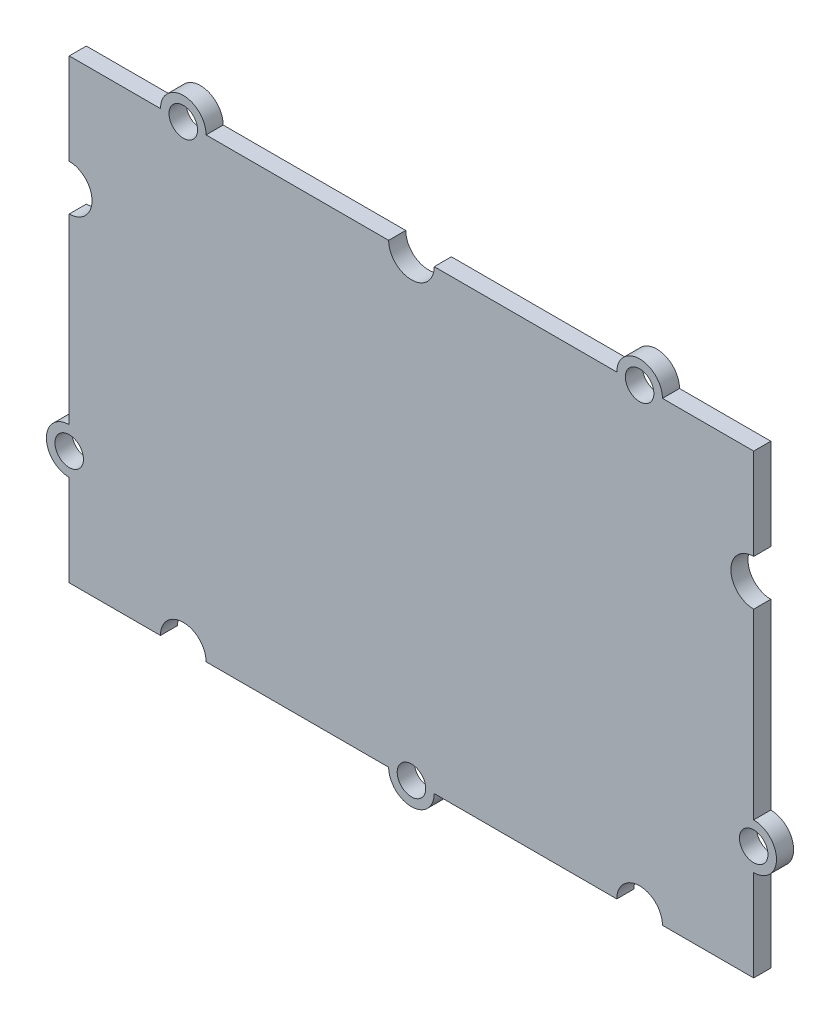
ISO-10303-21;
HEADER;
FILE_DESCRIPTION(('STEP AP214'),'2;1');
FILE_NAME('part.step','',(''),(''),'','','');
FILE_SCHEMA(('AUTOMOTIVE_DESIGN { 1 0 10303 214 1 1 1 1 }'));
ENDSEC;
DATA;
#1=APPLICATION_CONTEXT('core data for automotive mechanical design processes');
#2=APPLICATION_PROTOCOL_DEFINITION('international standard','automotive_design',2000,#1);
#3=PRODUCT_CONTEXT('',#1,'mechanical');
#4=PRODUCT('Part','Part','',(#3));
#5=PRODUCT_RELATED_PRODUCT_CATEGORY('part','',(#4));
#6=PRODUCT_DEFINITION_FORMATION('','',#4);
#7=PRODUCT_DEFINITION_CONTEXT('part definition',#1,'design');
#8=PRODUCT_DEFINITION('design','',#6,#7);
#9=PRODUCT_DEFINITION_SHAPE('','',#8);
#10=(LENGTH_UNIT() NAMED_UNIT(*) SI_UNIT(.MILLI.,.METRE.));
#11=(NAMED_UNIT(*) PLANE_ANGLE_UNIT() SI_UNIT($,.RADIAN.));
#12=(NAMED_UNIT(*) SI_UNIT($,.STERADIAN.) SOLID_ANGLE_UNIT());
#13=UNCERTAINTY_MEASURE_WITH_UNIT(LENGTH_MEASURE(1.E-05),#10,'distance_accuracy_value','');
#14=(GEOMETRIC_REPRESENTATION_CONTEXT(3) GLOBAL_UNCERTAINTY_ASSIGNED_CONTEXT((#13)) GLOBAL_UNIT_ASSIGNED_CONTEXT((#10,
#11,#12)) REPRESENTATION_CONTEXT('',''));
#15=CARTESIAN_POINT('',(0.,0.,0.));
#16=DIRECTION('',(0.,0.,1.));
#17=DIRECTION('',(1.,0.,0.));
#18=AXIS2_PLACEMENT_3D('',#15,#16,#17);
#19=CARTESIAN_POINT('',(-30.,10.,1.5));
#20=DIRECTION('',(0.,0.,1.));
#21=DIRECTION('',(1.,0.,0.));
#22=AXIS2_PLACEMENT_3D('',#19,#20,#21);
#23=PLANE('',#22);
#24=CARTESIAN_POINT('',(0.,-20.,1.5));
#25=DIRECTION('',(0.,0.,1.));
#26=DIRECTION('',(1.,0.,0.));
#27=AXIS2_PLACEMENT_3D('',#24,#25,#26);
#28=CIRCLE('',#27,1.25);
#29=CARTESIAN_POINT('',(1.25,-20.,1.5));
#30=VERTEX_POINT('',#29);
#31=EDGE_CURVE('E452',#30,#30,#28,.T.);
#32=ORIENTED_EDGE('',*,*,#31,.F.);
#33=EDGE_LOOP('',(#32));
#34=FACE_BOUND('',#33,.T.);
#35=CARTESIAN_POINT('',(20.,20.,1.5));
#36=DIRECTION('',(0.,0.,1.));
#37=DIRECTION('',(1.,0.,0.));
#38=AXIS2_PLACEMENT_3D('',#35,#36,#37);
#39=CIRCLE('',#38,1.25);
#40=CARTESIAN_POINT('',(21.25,20.,1.5));
#41=VERTEX_POINT('',#40);
#42=EDGE_CURVE('E464',#41,#41,#39,.T.);
#43=ORIENTED_EDGE('',*,*,#42,.F.);
#44=EDGE_LOOP('',(#43));
#45=FACE_BOUND('',#44,.T.);
#46=DIRECTION('',(0.,-1.,0.));
#47=VECTOR('',#46,1.);
#48=CARTESIAN_POINT('',(-30.,20.,1.5));
#49=LINE('',#48,#47);
#50=CARTESIAN_POINT('',(-30.,20.,1.5));
#51=VERTEX_POINT('',#50);
#52=CARTESIAN_POINT('',(-30.,12.,1.5));
#53=VERTEX_POINT('',#52);
#54=EDGE_CURVE('E274',#51,#53,#49,.T.);
#55=ORIENTED_EDGE('',*,*,#54,.T.);
#56=CARTESIAN_POINT('',(-30.,10.,1.5));
#57=DIRECTION('',(0.,0.,-1.));
#58=DIRECTION('',(1.,0.,0.));
#59=AXIS2_PLACEMENT_3D('',#56,#57,#58);
#60=CIRCLE('',#59,2.);
#61=CARTESIAN_POINT('',(-30.,8.,1.5));
#62=VERTEX_POINT('',#61);
#63=EDGE_CURVE('E142',#53,#62,#60,.T.);
#64=ORIENTED_EDGE('',*,*,#63,.T.);
#65=DIRECTION('',(0.,-1.,0.));
#66=VECTOR('',#65,1.);
#67=CARTESIAN_POINT('',(-30.,8.,1.5));
#68=LINE('',#67,#66);
#69=CARTESIAN_POINT('',(-30.,-8.,1.5));
#70=VERTEX_POINT('',#69);
#71=EDGE_CURVE('E337',#62,#70,#68,.T.);
#72=ORIENTED_EDGE('',*,*,#71,.T.);
#73=CARTESIAN_POINT('',(-30.,-10.,1.5));
#74=DIRECTION('',(0.,0.,1.));
#75=DIRECTION('',(1.,0.,0.));
#76=AXIS2_PLACEMENT_3D('',#73,#74,#75);
#77=CIRCLE('',#76,2.);
#78=CARTESIAN_POINT('',(-30.,-12.,1.5));
#79=VERTEX_POINT('',#78);
#80=EDGE_CURVE('E356',#70,#79,#77,.T.);
#81=ORIENTED_EDGE('',*,*,#80,.T.);
#82=DIRECTION('',(0.,-1.,0.));
#83=VECTOR('',#82,1.);
#84=CARTESIAN_POINT('',(-30.,-12.,1.5));
#85=LINE('',#84,#83);
#86=CARTESIAN_POINT('',(-30.,-20.,1.5));
#87=VERTEX_POINT('',#86);
#88=EDGE_CURVE('E353',#79,#87,#85,.T.);
#89=ORIENTED_EDGE('',*,*,#88,.T.);
#90=DIRECTION('',(1.,0.,0.));
#91=VECTOR('',#90,1.);
#92=CARTESIAN_POINT('',(-30.,-20.,1.5));
#93=LINE('',#92,#91);
#94=CARTESIAN_POINT('',(-22.,-20.,1.5));
#95=VERTEX_POINT('',#94);
#96=EDGE_CURVE('E355',#87,#95,#93,.T.);
#97=ORIENTED_EDGE('',*,*,#96,.T.);
#98=CARTESIAN_POINT('',(-20.,-20.,1.5));
#99=DIRECTION('',(0.,0.,-1.));
#100=DIRECTION('',(1.,0.,0.));
#101=AXIS2_PLACEMENT_3D('',#98,#99,#100);
#102=CIRCLE('',#101,2.);
#103=CARTESIAN_POINT('',(-18.,-20.,1.5));
#104=VERTEX_POINT('',#103);
#105=EDGE_CURVE('E358',#95,#104,#102,.T.);
#106=ORIENTED_EDGE('',*,*,#105,.T.);
#107=DIRECTION('',(1.,0.,0.));
#108=VECTOR('',#107,1.);
#109=CARTESIAN_POINT('',(-18.,-20.,1.5));
#110=LINE('',#109,#108);
#111=CARTESIAN_POINT('',(-2.,-20.,1.5));
#112=VERTEX_POINT('',#111);
#113=EDGE_CURVE('E364',#104,#112,#110,.T.);
#114=ORIENTED_EDGE('',*,*,#113,.T.);
#115=CARTESIAN_POINT('',(0.,-20.,1.5));
#116=DIRECTION('',(0.,0.,1.));
#117=DIRECTION('',(1.,0.,0.));
#118=AXIS2_PLACEMENT_3D('',#115,#116,#117);
#119=CIRCLE('',#118,2.);
#120=CARTESIAN_POINT('',(2.,-20.,1.5));
#121=VERTEX_POINT('',#120);
#122=EDGE_CURVE('E366',#112,#121,#119,.T.);
#123=ORIENTED_EDGE('',*,*,#122,.T.);
#124=DIRECTION('',(1.,0.,0.));
#125=VECTOR('',#124,1.);
#126=CARTESIAN_POINT('',(2.,-20.,1.5));
#127=LINE('',#126,#125);
#128=CARTESIAN_POINT('',(18.,-20.,1.5));
#129=VERTEX_POINT('',#128);
#130=EDGE_CURVE('E368',#121,#129,#127,.T.);
#131=ORIENTED_EDGE('',*,*,#130,.T.);
#132=CARTESIAN_POINT('',(20.,-20.,1.5));
#133=DIRECTION('',(0.,0.,-1.));
#134=DIRECTION('',(1.,0.,0.));
#135=AXIS2_PLACEMENT_3D('',#132,#133,#134);
#136=CIRCLE('',#135,2.);
#137=CARTESIAN_POINT('',(22.,-20.,1.5));
#138=VERTEX_POINT('',#137);
#139=EDGE_CURVE('E370',#129,#138,#136,.T.);
#140=ORIENTED_EDGE('',*,*,#139,.T.);
#141=DIRECTION('',(1.,0.,0.));
#142=VECTOR('',#141,1.);
#143=CARTESIAN_POINT('',(22.,-20.,1.5));
#144=LINE('',#143,#142);
#145=CARTESIAN_POINT('',(30.,-20.,1.5));
#146=VERTEX_POINT('',#145);
#147=EDGE_CURVE('E372',#138,#146,#144,.T.);
#148=ORIENTED_EDGE('',*,*,#147,.T.);
#149=DIRECTION('',(0.,1.,0.));
#150=VECTOR('',#149,1.);
#151=CARTESIAN_POINT('',(30.,-12.,1.5));
#152=LINE('',#151,#150);
#153=CARTESIAN_POINT('',(30.,-12.,1.5));
#154=VERTEX_POINT('',#153);
#155=EDGE_CURVE('E374',#146,#154,#152,.T.);
#156=ORIENTED_EDGE('',*,*,#155,.T.);
#157=CARTESIAN_POINT('',(30.,-10.,1.5));
#158=DIRECTION('',(0.,0.,1.));
#159=DIRECTION('',(1.,0.,0.));
#160=AXIS2_PLACEMENT_3D('',#157,#158,#159);
#161=CIRCLE('',#160,2.);
#162=CARTESIAN_POINT('',(30.,-8.,1.5));
#163=VERTEX_POINT('',#162);
#164=EDGE_CURVE('E376',#154,#163,#161,.T.);
#165=ORIENTED_EDGE('',*,*,#164,.T.);
#166=DIRECTION('',(0.,1.,0.));
#167=VECTOR('',#166,1.);
#168=CARTESIAN_POINT('',(30.,8.,1.5));
#169=LINE('',#168,#167);
#170=CARTESIAN_POINT('',(30.,8.,1.5));
#171=VERTEX_POINT('',#170);
#172=EDGE_CURVE('E378',#163,#171,#169,.T.);
#173=ORIENTED_EDGE('',*,*,#172,.T.);
#174=CARTESIAN_POINT('',(30.,10.,1.5));
#175=DIRECTION('',(0.,0.,-1.));
#176=DIRECTION('',(1.,0.,0.));
#177=AXIS2_PLACEMENT_3D('',#174,#175,#176);
#178=CIRCLE('',#177,2.);
#179=CARTESIAN_POINT('',(30.,12.,1.5));
#180=VERTEX_POINT('',#179);
#181=EDGE_CURVE('E380',#171,#180,#178,.T.);
#182=ORIENTED_EDGE('',*,*,#181,.T.);
#183=DIRECTION('',(0.,1.,0.));
#184=VECTOR('',#183,1.);
#185=CARTESIAN_POINT('',(30.,20.,1.5));
#186=LINE('',#185,#184);
#187=CARTESIAN_POINT('',(30.,20.,1.5));
#188=VERTEX_POINT('',#187);
#189=EDGE_CURVE('E382',#180,#188,#186,.T.);
#190=ORIENTED_EDGE('',*,*,#189,.T.);
#191=DIRECTION('',(-1.,0.,0.));
#192=VECTOR('',#191,1.);
#193=CARTESIAN_POINT('',(22.,20.,1.5));
#194=LINE('',#193,#192);
#195=CARTESIAN_POINT('',(22.,20.,1.5));
#196=VERTEX_POINT('',#195);
#197=EDGE_CURVE('E384',#188,#196,#194,.T.);
#198=ORIENTED_EDGE('',*,*,#197,.T.);
#199=CARTESIAN_POINT('',(20.,20.,1.5));
#200=DIRECTION('',(0.,0.,1.));
#201=DIRECTION('',(1.,0.,0.));
#202=AXIS2_PLACEMENT_3D('',#199,#200,#201);
#203=CIRCLE('',#202,2.);
#204=CARTESIAN_POINT('',(18.,20.,1.5));
#205=VERTEX_POINT('',#204);
#206=EDGE_CURVE('E386',#196,#205,#203,.T.);
#207=ORIENTED_EDGE('',*,*,#206,.T.);
#208=DIRECTION('',(-1.,0.,0.));
#209=VECTOR('',#208,1.);
#210=CARTESIAN_POINT('',(2.,20.,1.5));
#211=LINE('',#210,#209);
#212=CARTESIAN_POINT('',(2.,20.,1.5));
#213=VERTEX_POINT('',#212);
#214=EDGE_CURVE('E388',#205,#213,#211,.T.);
#215=ORIENTED_EDGE('',*,*,#214,.T.);
#216=CARTESIAN_POINT('',(0.,20.,1.5));
#217=DIRECTION('',(0.,0.,-1.));
#218=DIRECTION('',(1.,0.,0.));
#219=AXIS2_PLACEMENT_3D('',#216,#217,#218);
#220=CIRCLE('',#219,2.);
#221=CARTESIAN_POINT('',(-2.,20.,1.5));
#222=VERTEX_POINT('',#221);
#223=EDGE_CURVE('E209',#213,#222,#220,.T.);
#224=ORIENTED_EDGE('',*,*,#223,.T.);
#225=DIRECTION('',(-1.,0.,0.));
#226=VECTOR('',#225,1.);
#227=CARTESIAN_POINT('',(-18.,20.,1.5));
#228=LINE('',#227,#226);
#229=CARTESIAN_POINT('',(-18.,20.,1.5));
#230=VERTEX_POINT('',#229);
#231=EDGE_CURVE('E203',#222,#230,#228,.T.);
#232=ORIENTED_EDGE('',*,*,#231,.T.);
#233=CARTESIAN_POINT('',(-20.,20.,1.5));
#234=DIRECTION('',(0.,0.,1.));
#235=DIRECTION('',(1.,0.,0.));
#236=AXIS2_PLACEMENT_3D('',#233,#234,#235);
#237=CIRCLE('',#236,2.);
#238=CARTESIAN_POINT('',(-22.,20.,1.5));
#239=VERTEX_POINT('',#238);
#240=EDGE_CURVE('E207',#230,#239,#237,.T.);
#241=ORIENTED_EDGE('',*,*,#240,.T.);
#242=DIRECTION('',(-1.,0.,0.));
#243=VECTOR('',#242,1.);
#244=CARTESIAN_POINT('',(-30.,20.,1.5));
#245=LINE('',#244,#243);
#246=EDGE_CURVE('E51',#239,#51,#245,.T.);
#247=ORIENTED_EDGE('',*,*,#246,.T.);
#248=EDGE_LOOP('',(#55,#64,#72,#81,#89,#97,#106,#114,#123,#131,#140,#148,#156,#165,#173,#182,
#190,#198,#207,#215,#224,#232,#241,#247));
#249=FACE_BOUND('',#248,.T.);
#250=CARTESIAN_POINT('',(-20.,20.,1.5));
#251=DIRECTION('',(0.,0.,1.));
#252=DIRECTION('',(1.,0.,0.));
#253=AXIS2_PLACEMENT_3D('',#250,#251,#252);
#254=CIRCLE('',#253,1.25);
#255=CARTESIAN_POINT('',(-18.75,20.,1.5));
#256=VERTEX_POINT('',#255);
#257=EDGE_CURVE('E231',#256,#256,#254,.T.);
#258=ORIENTED_EDGE('',*,*,#257,.F.);
#259=EDGE_LOOP('',(#258));
#260=FACE_BOUND('',#259,.T.);
#261=CARTESIAN_POINT('',(30.,-10.,1.5));
#262=DIRECTION('',(0.,0.,1.));
#263=DIRECTION('',(1.,0.,0.));
#264=AXIS2_PLACEMENT_3D('',#261,#262,#263);
#265=CIRCLE('',#264,1.25);
#266=CARTESIAN_POINT('',(31.25,-10.,1.5));
#267=VERTEX_POINT('',#266);
#268=EDGE_CURVE('E458',#267,#267,#265,.T.);
#269=ORIENTED_EDGE('',*,*,#268,.F.);
#270=EDGE_LOOP('',(#269));
#271=FACE_BOUND('',#270,.T.);
#272=CARTESIAN_POINT('',(-30.,-10.,1.5));
#273=DIRECTION('',(0.,0.,1.));
#274=DIRECTION('',(1.,0.,0.));
#275=AXIS2_PLACEMENT_3D('',#272,#273,#274);
#276=CIRCLE('',#275,1.25);
#277=CARTESIAN_POINT('',(-28.75,-10.,1.5));
#278=VERTEX_POINT('',#277);
#279=EDGE_CURVE('E443',#278,#278,#276,.T.);
#280=ORIENTED_EDGE('',*,*,#279,.F.);
#281=EDGE_LOOP('',(#280));
#282=FACE_BOUND('',#281,.T.);
#283=ADVANCED_FACE('F34',(#34,#45,#249,#260,#271,#282),#23,.T.);
#284=CARTESIAN_POINT('',(-30.,10.,0.));
#285=DIRECTION('',(0.,0.,1.));
#286=DIRECTION('',(1.,0.,0.));
#287=AXIS2_PLACEMENT_3D('',#284,#285,#286);
#288=PLANE('',#287);
#289=DIRECTION('',(0.,-1.,0.));
#290=VECTOR('',#289,1.);
#291=CARTESIAN_POINT('',(-30.,20.,0.));
#292=LINE('',#291,#290);
#293=CARTESIAN_POINT('',(-30.,20.,0.));
#294=VERTEX_POINT('',#293);
#295=CARTESIAN_POINT('',(-30.,12.,0.));
#296=VERTEX_POINT('',#295);
#297=EDGE_CURVE('E227',#294,#296,#292,.T.);
#298=ORIENTED_EDGE('',*,*,#297,.F.);
#299=DIRECTION('',(-1.,0.,0.));
#300=VECTOR('',#299,1.);
#301=CARTESIAN_POINT('',(-30.,20.,0.));
#302=LINE('',#301,#300);
#303=CARTESIAN_POINT('',(-22.,20.,0.));
#304=VERTEX_POINT('',#303);
#305=EDGE_CURVE('E134',#304,#294,#302,.T.);
#306=ORIENTED_EDGE('',*,*,#305,.F.);
#307=CARTESIAN_POINT('',(-20.,20.,0.));
#308=DIRECTION('',(0.,0.,1.));
#309=DIRECTION('',(1.,0.,0.));
#310=AXIS2_PLACEMENT_3D('',#307,#308,#309);
#311=CIRCLE('',#310,2.);
#312=CARTESIAN_POINT('',(-18.,20.,0.));
#313=VERTEX_POINT('',#312);
#314=EDGE_CURVE('E128',#313,#304,#311,.T.);
#315=ORIENTED_EDGE('',*,*,#314,.F.);
#316=DIRECTION('',(-1.,0.,0.));
#317=VECTOR('',#316,1.);
#318=CARTESIAN_POINT('',(-18.,20.,0.));
#319=LINE('',#318,#317);
#320=CARTESIAN_POINT('',(-2.,20.,0.));
#321=VERTEX_POINT('',#320);
#322=EDGE_CURVE('E217',#321,#313,#319,.T.);
#323=ORIENTED_EDGE('',*,*,#322,.F.);
#324=CARTESIAN_POINT('',(0.,20.,0.));
#325=DIRECTION('',(0.,0.,-1.));
#326=DIRECTION('',(1.,0.,0.));
#327=AXIS2_PLACEMENT_3D('',#324,#325,#326);
#328=CIRCLE('',#327,2.);
#329=CARTESIAN_POINT('',(2.,20.,0.));
#330=VERTEX_POINT('',#329);
#331=EDGE_CURVE('E269',#330,#321,#328,.T.);
#332=ORIENTED_EDGE('',*,*,#331,.F.);
#333=DIRECTION('',(-1.,0.,0.));
#334=VECTOR('',#333,1.);
#335=CARTESIAN_POINT('',(2.,20.,0.));
#336=LINE('',#335,#334);
#337=CARTESIAN_POINT('',(18.,20.,0.));
#338=VERTEX_POINT('',#337);
#339=EDGE_CURVE('E267',#338,#330,#336,.T.);
#340=ORIENTED_EDGE('',*,*,#339,.F.);
#341=CARTESIAN_POINT('',(20.,20.,0.));
#342=DIRECTION('',(0.,0.,1.));
#343=DIRECTION('',(1.,0.,0.));
#344=AXIS2_PLACEMENT_3D('',#341,#342,#343);
#345=CIRCLE('',#344,2.);
#346=CARTESIAN_POINT('',(22.,20.,0.));
#347=VERTEX_POINT('',#346);
#348=EDGE_CURVE('E265',#347,#338,#345,.T.);
#349=ORIENTED_EDGE('',*,*,#348,.F.);
#350=DIRECTION('',(-1.,0.,0.));
#351=VECTOR('',#350,1.);
#352=CARTESIAN_POINT('',(22.,20.,0.));
#353=LINE('',#352,#351);
#354=CARTESIAN_POINT('',(30.,20.,0.));
#355=VERTEX_POINT('',#354);
#356=EDGE_CURVE('E263',#355,#347,#353,.T.);
#357=ORIENTED_EDGE('',*,*,#356,.F.);
#358=DIRECTION('',(0.,1.,0.));
#359=VECTOR('',#358,1.);
#360=CARTESIAN_POINT('',(30.,20.,0.));
#361=LINE('',#360,#359);
#362=CARTESIAN_POINT('',(30.,12.,0.));
#363=VERTEX_POINT('',#362);
#364=EDGE_CURVE('E261',#363,#355,#361,.T.);
#365=ORIENTED_EDGE('',*,*,#364,.F.);
#366=CARTESIAN_POINT('',(30.,10.,0.));
#367=DIRECTION('',(0.,0.,-1.));
#368=DIRECTION('',(1.,0.,0.));
#369=AXIS2_PLACEMENT_3D('',#366,#367,#368);
#370=CIRCLE('',#369,2.);
#371=CARTESIAN_POINT('',(30.,8.,0.));
#372=VERTEX_POINT('',#371);
#373=EDGE_CURVE('E259',#372,#363,#370,.T.);
#374=ORIENTED_EDGE('',*,*,#373,.F.);
#375=DIRECTION('',(0.,1.,0.));
#376=VECTOR('',#375,1.);
#377=CARTESIAN_POINT('',(30.,8.,0.));
#378=LINE('',#377,#376);
#379=CARTESIAN_POINT('',(30.,-8.,0.));
#380=VERTEX_POINT('',#379);
#381=EDGE_CURVE('E257',#380,#372,#378,.T.);
#382=ORIENTED_EDGE('',*,*,#381,.F.);
#383=CARTESIAN_POINT('',(30.,-10.,0.));
#384=DIRECTION('',(0.,0.,1.));
#385=DIRECTION('',(1.,0.,0.));
#386=AXIS2_PLACEMENT_3D('',#383,#384,#385);
#387=CIRCLE('',#386,2.);
#388=CARTESIAN_POINT('',(30.,-12.,0.));
#389=VERTEX_POINT('',#388);
#390=EDGE_CURVE('E255',#389,#380,#387,.T.);
#391=ORIENTED_EDGE('',*,*,#390,.F.);
#392=DIRECTION('',(0.,1.,0.));
#393=VECTOR('',#392,1.);
#394=CARTESIAN_POINT('',(30.,-12.,0.));
#395=LINE('',#394,#393);
#396=CARTESIAN_POINT('',(30.,-20.,0.));
#397=VERTEX_POINT('',#396);
#398=EDGE_CURVE('E253',#397,#389,#395,.T.);
#399=ORIENTED_EDGE('',*,*,#398,.F.);
#400=DIRECTION('',(1.,0.,0.));
#401=VECTOR('',#400,1.);
#402=CARTESIAN_POINT('',(22.,-20.,0.));
#403=LINE('',#402,#401);
#404=CARTESIAN_POINT('',(22.,-20.,0.));
#405=VERTEX_POINT('',#404);
#406=EDGE_CURVE('E251',#405,#397,#403,.T.);
#407=ORIENTED_EDGE('',*,*,#406,.F.);
#408=CARTESIAN_POINT('',(20.,-20.,0.));
#409=DIRECTION('',(0.,0.,-1.));
#410=DIRECTION('',(1.,0.,0.));
#411=AXIS2_PLACEMENT_3D('',#408,#409,#410);
#412=CIRCLE('',#411,2.);
#413=CARTESIAN_POINT('',(18.,-20.,0.));
#414=VERTEX_POINT('',#413);
#415=EDGE_CURVE('E249',#414,#405,#412,.T.);
#416=ORIENTED_EDGE('',*,*,#415,.F.);
#417=DIRECTION('',(1.,0.,0.));
#418=VECTOR('',#417,1.);
#419=CARTESIAN_POINT('',(2.,-20.,0.));
#420=LINE('',#419,#418);
#421=CARTESIAN_POINT('',(2.,-20.,0.));
#422=VERTEX_POINT('',#421);
#423=EDGE_CURVE('E247',#422,#414,#420,.T.);
#424=ORIENTED_EDGE('',*,*,#423,.F.);
#425=CARTESIAN_POINT('',(0.,-20.,0.));
#426=DIRECTION('',(0.,0.,1.));
#427=DIRECTION('',(1.,0.,0.));
#428=AXIS2_PLACEMENT_3D('',#425,#426,#427);
#429=CIRCLE('',#428,2.);
#430=CARTESIAN_POINT('',(-2.,-20.,0.));
#431=VERTEX_POINT('',#430);
#432=EDGE_CURVE('E245',#431,#422,#429,.T.);
#433=ORIENTED_EDGE('',*,*,#432,.F.);
#434=DIRECTION('',(1.,0.,0.));
#435=VECTOR('',#434,1.);
#436=CARTESIAN_POINT('',(-18.,-20.,0.));
#437=LINE('',#436,#435);
#438=CARTESIAN_POINT('',(-18.,-20.,0.));
#439=VERTEX_POINT('',#438);
#440=EDGE_CURVE('E243',#439,#431,#437,.T.);
#441=ORIENTED_EDGE('',*,*,#440,.F.);
#442=CARTESIAN_POINT('',(-20.,-20.,0.));
#443=DIRECTION('',(0.,0.,-1.));
#444=DIRECTION('',(1.,0.,0.));
#445=AXIS2_PLACEMENT_3D('',#442,#443,#444);
#446=CIRCLE('',#445,2.);
#447=CARTESIAN_POINT('',(-22.,-20.,0.));
#448=VERTEX_POINT('',#447);
#449=EDGE_CURVE('E241',#448,#439,#446,.T.);
#450=ORIENTED_EDGE('',*,*,#449,.F.);
#451=DIRECTION('',(1.,0.,0.));
#452=VECTOR('',#451,1.);
#453=CARTESIAN_POINT('',(-30.,-20.,0.));
#454=LINE('',#453,#452);
#455=CARTESIAN_POINT('',(-30.,-20.,0.));
#456=VERTEX_POINT('',#455);
#457=EDGE_CURVE('E239',#456,#448,#454,.T.);
#458=ORIENTED_EDGE('',*,*,#457,.F.);
#459=DIRECTION('',(0.,-1.,0.));
#460=VECTOR('',#459,1.);
#461=CARTESIAN_POINT('',(-30.,-12.,0.));
#462=LINE('',#461,#460);
#463=CARTESIAN_POINT('',(-30.,-12.,0.));
#464=VERTEX_POINT('',#463);
#465=EDGE_CURVE('E237',#464,#456,#462,.T.);
#466=ORIENTED_EDGE('',*,*,#465,.F.);
#467=CARTESIAN_POINT('',(-30.,-10.,0.));
#468=DIRECTION('',(0.,0.,1.));
#469=DIRECTION('',(1.,0.,0.));
#470=AXIS2_PLACEMENT_3D('',#467,#468,#469);
#471=CIRCLE('',#470,2.);
#472=CARTESIAN_POINT('',(-30.,-8.,0.));
#473=VERTEX_POINT('',#472);
#474=EDGE_CURVE('E235',#473,#464,#471,.T.);
#475=ORIENTED_EDGE('',*,*,#474,.F.);
#476=DIRECTION('',(0.,-1.,0.));
#477=VECTOR('',#476,1.);
#478=CARTESIAN_POINT('',(-30.,8.,0.));
#479=LINE('',#478,#477);
#480=CARTESIAN_POINT('',(-30.,8.,0.));
#481=VERTEX_POINT('',#480);
#482=EDGE_CURVE('E233',#481,#473,#479,.T.);
#483=ORIENTED_EDGE('',*,*,#482,.F.);
#484=CARTESIAN_POINT('',(-30.,10.,0.));
#485=DIRECTION('',(0.,0.,-1.));
#486=DIRECTION('',(1.,0.,0.));
#487=AXIS2_PLACEMENT_3D('',#484,#485,#486);
#488=CIRCLE('',#487,2.);
#489=EDGE_CURVE('E230',#296,#481,#488,.T.);
#490=ORIENTED_EDGE('',*,*,#489,.F.);
#491=EDGE_LOOP('',(#298,#306,#315,#323,#332,#340,#349,#357,#365,#374,#382,#391,#399,#407,#416,
#424,#433,#441,#450,#458,#466,#475,#483,#490));
#492=FACE_BOUND('',#491,.T.);
#493=CARTESIAN_POINT('',(-20.,20.,0.));
#494=DIRECTION('',(0.,0.,1.));
#495=DIRECTION('',(1.,0.,0.));
#496=AXIS2_PLACEMENT_3D('',#493,#494,#495);
#497=CIRCLE('',#496,1.25);
#498=CARTESIAN_POINT('',(-18.75,20.,0.));
#499=VERTEX_POINT('',#498);
#500=EDGE_CURVE('E467',#499,#499,#497,.T.);
#501=ORIENTED_EDGE('',*,*,#500,.T.);
#502=EDGE_LOOP('',(#501));
#503=FACE_BOUND('',#502,.T.);
#504=CARTESIAN_POINT('',(20.,20.,0.));
#505=DIRECTION('',(0.,0.,1.));
#506=DIRECTION('',(1.,0.,0.));
#507=AXIS2_PLACEMENT_3D('',#504,#505,#506);
#508=CIRCLE('',#507,1.25);
#509=CARTESIAN_POINT('',(21.25,20.,0.));
#510=VERTEX_POINT('',#509);
#511=EDGE_CURVE('E461',#510,#510,#508,.T.);
#512=ORIENTED_EDGE('',*,*,#511,.T.);
#513=EDGE_LOOP('',(#512));
#514=FACE_BOUND('',#513,.T.);
#515=CARTESIAN_POINT('',(30.,-10.,0.));
#516=DIRECTION('',(0.,0.,1.));
#517=DIRECTION('',(1.,0.,0.));
#518=AXIS2_PLACEMENT_3D('',#515,#516,#517);
#519=CIRCLE('',#518,1.25);
#520=CARTESIAN_POINT('',(31.25,-10.,0.));
#521=VERTEX_POINT('',#520);
#522=EDGE_CURVE('E455',#521,#521,#519,.T.);
#523=ORIENTED_EDGE('',*,*,#522,.T.);
#524=EDGE_LOOP('',(#523));
#525=FACE_BOUND('',#524,.T.);
#526=CARTESIAN_POINT('',(0.,-20.,0.));
#527=DIRECTION('',(0.,0.,1.));
#528=DIRECTION('',(1.,0.,0.));
#529=AXIS2_PLACEMENT_3D('',#526,#527,#528);
#530=CIRCLE('',#529,1.25);
#531=CARTESIAN_POINT('',(1.25,-20.,0.));
#532=VERTEX_POINT('',#531);
#533=EDGE_CURVE('E449',#532,#532,#530,.T.);
#534=ORIENTED_EDGE('',*,*,#533,.T.);
#535=EDGE_LOOP('',(#534));
#536=FACE_BOUND('',#535,.T.);
#537=CARTESIAN_POINT('',(-30.,-10.,0.));
#538=DIRECTION('',(0.,0.,1.));
#539=DIRECTION('',(1.,0.,0.));
#540=AXIS2_PLACEMENT_3D('',#537,#538,#539);
#541=CIRCLE('',#540,1.25);
#542=CARTESIAN_POINT('',(-28.75,-10.,0.));
#543=VERTEX_POINT('',#542);
#544=EDGE_CURVE('E446',#543,#543,#541,.T.);
#545=ORIENTED_EDGE('',*,*,#544,.T.);
#546=EDGE_LOOP('',(#545));
#547=FACE_BOUND('',#546,.T.);
#548=ADVANCED_FACE('F341',(#492,#503,#514,#525,#536,#547),#288,.F.);
#549=CARTESIAN_POINT('',(-30.,20.,1.5));
#550=DIRECTION('',(1.,0.,0.));
#551=DIRECTION('',(0.,0.,-1.));
#552=AXIS2_PLACEMENT_3D('',#549,#550,#551);
#553=PLANE('',#552);
#554=ORIENTED_EDGE('',*,*,#297,.T.);
#555=DIRECTION('',(0.,0.,-1.));
#556=VECTOR('',#555,1.);
#557=CARTESIAN_POINT('',(-30.,12.,1.5));
#558=LINE('',#557,#556);
#559=EDGE_CURVE('E11',#53,#296,#558,.T.);
#560=ORIENTED_EDGE('',*,*,#559,.F.);
#561=ORIENTED_EDGE('',*,*,#54,.F.);
#562=DIRECTION('',(0.,0.,-1.));
#563=VECTOR('',#562,1.);
#564=CARTESIAN_POINT('',(-30.,20.,1.5));
#565=LINE('',#564,#563);
#566=EDGE_CURVE('E223',#51,#294,#565,.T.);
#567=ORIENTED_EDGE('',*,*,#566,.T.);
#568=EDGE_LOOP('',(#554,#560,#561,#567));
#569=FACE_BOUND('',#568,.T.);
#570=ADVANCED_FACE('F36',(#569),#553,.F.);
#571=CARTESIAN_POINT('',(-30.,10.,1.5));
#572=DIRECTION('',(0.,0.,-1.));
#573=DIRECTION('',(-1.,0.,0.));
#574=AXIS2_PLACEMENT_3D('',#571,#572,#573);
#575=CYLINDRICAL_SURFACE('',#574,2.);
#576=ORIENTED_EDGE('',*,*,#489,.T.);
#577=DIRECTION('',(0.,0.,-1.));
#578=VECTOR('',#577,1.);
#579=CARTESIAN_POINT('',(-30.,8.,1.5));
#580=LINE('',#579,#578);
#581=EDGE_CURVE('E43',#62,#481,#580,.T.);
#582=ORIENTED_EDGE('',*,*,#581,.F.);
#583=ORIENTED_EDGE('',*,*,#63,.F.);
#584=ORIENTED_EDGE('',*,*,#559,.T.);
#585=EDGE_LOOP('',(#576,#582,#583,#584));
#586=FACE_BOUND('',#585,.T.);
#587=ADVANCED_FACE('F706',(#586),#575,.F.);
#588=CARTESIAN_POINT('',(-30.,8.,1.5));
#589=DIRECTION('',(1.,0.,0.));
#590=DIRECTION('',(0.,0.,-1.));
#591=AXIS2_PLACEMENT_3D('',#588,#589,#590);
#592=PLANE('',#591);
#593=ORIENTED_EDGE('',*,*,#482,.T.);
#594=DIRECTION('',(0.,0.,-1.));
#595=VECTOR('',#594,1.);
#596=CARTESIAN_POINT('',(-30.,-8.,1.5));
#597=LINE('',#596,#595);
#598=EDGE_CURVE('E329',#70,#473,#597,.T.);
#599=ORIENTED_EDGE('',*,*,#598,.F.);
#600=ORIENTED_EDGE('',*,*,#71,.F.);
#601=ORIENTED_EDGE('',*,*,#581,.T.);
#602=EDGE_LOOP('',(#593,#599,#600,#601));
#603=FACE_BOUND('',#602,.T.);
#604=ADVANCED_FACE('F335',(#603),#592,.F.);
#605=CARTESIAN_POINT('',(-30.,-10.,1.5));
#606=DIRECTION('',(0.,0.,-1.));
#607=DIRECTION('',(-1.,0.,0.));
#608=AXIS2_PLACEMENT_3D('',#605,#606,#607);
#609=CYLINDRICAL_SURFACE('',#608,2.);
#610=ORIENTED_EDGE('',*,*,#474,.T.);
#611=DIRECTION('',(0.,0.,-1.));
#612=VECTOR('',#611,1.);
#613=CARTESIAN_POINT('',(-30.,-12.,1.5));
#614=LINE('',#613,#612);
#615=EDGE_CURVE('E326',#79,#464,#614,.T.);
#616=ORIENTED_EDGE('',*,*,#615,.F.);
#617=ORIENTED_EDGE('',*,*,#80,.F.);
#618=ORIENTED_EDGE('',*,*,#598,.T.);
#619=EDGE_LOOP('',(#610,#616,#617,#618));
#620=FACE_BOUND('',#619,.T.);
#621=ADVANCED_FACE('F347',(#620),#609,.T.);
#622=CARTESIAN_POINT('',(-30.,-12.,1.5));
#623=DIRECTION('',(1.,0.,0.));
#624=DIRECTION('',(0.,0.,-1.));
#625=AXIS2_PLACEMENT_3D('',#622,#623,#624);
#626=PLANE('',#625);
#627=ORIENTED_EDGE('',*,*,#465,.T.);
#628=DIRECTION('',(0.,0.,-1.));
#629=VECTOR('',#628,1.);
#630=CARTESIAN_POINT('',(-30.,-20.,1.5));
#631=LINE('',#630,#629);
#632=EDGE_CURVE('E323',#87,#456,#631,.T.);
#633=ORIENTED_EDGE('',*,*,#632,.F.);
#634=ORIENTED_EDGE('',*,*,#88,.F.);
#635=ORIENTED_EDGE('',*,*,#615,.T.);
#636=EDGE_LOOP('',(#627,#633,#634,#635));
#637=FACE_BOUND('',#636,.T.);
#638=ADVANCED_FACE('F351',(#637),#626,.F.);
#639=CARTESIAN_POINT('',(-30.,-20.,1.5));
#640=DIRECTION('',(0.,1.,0.));
#641=DIRECTION('',(0.,0.,1.));
#642=AXIS2_PLACEMENT_3D('',#639,#640,#641);
#643=PLANE('',#642);
#644=ORIENTED_EDGE('',*,*,#457,.T.);
#645=DIRECTION('',(0.,0.,-1.));
#646=VECTOR('',#645,1.);
#647=CARTESIAN_POINT('',(-22.,-20.,1.5));
#648=LINE('',#647,#646);
#649=EDGE_CURVE('E320',#95,#448,#648,.T.);
#650=ORIENTED_EDGE('',*,*,#649,.F.);
#651=ORIENTED_EDGE('',*,*,#96,.F.);
#652=ORIENTED_EDGE('',*,*,#632,.T.);
#653=EDGE_LOOP('',(#644,#650,#651,#652));
#654=FACE_BOUND('',#653,.T.);
#655=ADVANCED_FACE('F671',(#654),#643,.F.);
#656=CARTESIAN_POINT('',(-20.,-20.,1.5));
#657=DIRECTION('',(0.,0.,-1.));
#658=DIRECTION('',(-1.,0.,0.));
#659=AXIS2_PLACEMENT_3D('',#656,#657,#658);
#660=CYLINDRICAL_SURFACE('',#659,2.);
#661=ORIENTED_EDGE('',*,*,#449,.T.);
#662=DIRECTION('',(0.,0.,-1.));
#663=VECTOR('',#662,1.);
#664=CARTESIAN_POINT('',(-18.,-20.,1.5));
#665=LINE('',#664,#663);
#666=EDGE_CURVE('E317',#104,#439,#665,.T.);
#667=ORIENTED_EDGE('',*,*,#666,.F.);
#668=ORIENTED_EDGE('',*,*,#105,.F.);
#669=ORIENTED_EDGE('',*,*,#649,.T.);
#670=EDGE_LOOP('',(#661,#667,#668,#669));
#671=FACE_BOUND('',#670,.T.);
#672=ADVANCED_FACE('F661',(#671),#660,.F.);
#673=CARTESIAN_POINT('',(-18.,-20.,1.5));
#674=DIRECTION('',(0.,1.,0.));
#675=DIRECTION('',(0.,0.,1.));
#676=AXIS2_PLACEMENT_3D('',#673,#674,#675);
#677=PLANE('',#676);
#678=ORIENTED_EDGE('',*,*,#440,.T.);
#679=DIRECTION('',(0.,0.,-1.));
#680=VECTOR('',#679,1.);
#681=CARTESIAN_POINT('',(-2.,-20.,1.5));
#682=LINE('',#681,#680);
#683=EDGE_CURVE('E314',#112,#431,#682,.T.);
#684=ORIENTED_EDGE('',*,*,#683,.F.);
#685=ORIENTED_EDGE('',*,*,#113,.F.);
#686=ORIENTED_EDGE('',*,*,#666,.T.);
#687=EDGE_LOOP('',(#678,#684,#685,#686));
#688=FACE_BOUND('',#687,.T.);
#689=ADVANCED_FACE('F651',(#688),#677,.F.);
#690=CARTESIAN_POINT('',(0.,-20.,1.5));
#691=DIRECTION('',(0.,0.,-1.));
#692=DIRECTION('',(-1.,0.,0.));
#693=AXIS2_PLACEMENT_3D('',#690,#691,#692);
#694=CYLINDRICAL_SURFACE('',#693,2.);
#695=ORIENTED_EDGE('',*,*,#432,.T.);
#696=DIRECTION('',(0.,0.,-1.));
#697=VECTOR('',#696,1.);
#698=CARTESIAN_POINT('',(2.,-20.,1.5));
#699=LINE('',#698,#697);
#700=EDGE_CURVE('E311',#121,#422,#699,.T.);
#701=ORIENTED_EDGE('',*,*,#700,.F.);
#702=ORIENTED_EDGE('',*,*,#122,.F.);
#703=ORIENTED_EDGE('',*,*,#683,.T.);
#704=EDGE_LOOP('',(#695,#701,#702,#703));
#705=FACE_BOUND('',#704,.T.);
#706=ADVANCED_FACE('F641',(#705),#694,.T.);
#707=CARTESIAN_POINT('',(2.,-20.,1.5));
#708=DIRECTION('',(0.,1.,0.));
#709=DIRECTION('',(0.,0.,1.));
#710=AXIS2_PLACEMENT_3D('',#707,#708,#709);
#711=PLANE('',#710);
#712=ORIENTED_EDGE('',*,*,#423,.T.);
#713=DIRECTION('',(0.,0.,-1.));
#714=VECTOR('',#713,1.);
#715=CARTESIAN_POINT('',(18.,-20.,1.5));
#716=LINE('',#715,#714);
#717=EDGE_CURVE('E308',#129,#414,#716,.T.);
#718=ORIENTED_EDGE('',*,*,#717,.F.);
#719=ORIENTED_EDGE('',*,*,#130,.F.);
#720=ORIENTED_EDGE('',*,*,#700,.T.);
#721=EDGE_LOOP('',(#712,#718,#719,#720));
#722=FACE_BOUND('',#721,.T.);
#723=ADVANCED_FACE('F631',(#722),#711,.F.);
#724=CARTESIAN_POINT('',(20.,-20.,1.5));
#725=DIRECTION('',(0.,0.,-1.));
#726=DIRECTION('',(-1.,0.,0.));
#727=AXIS2_PLACEMENT_3D('',#724,#725,#726);
#728=CYLINDRICAL_SURFACE('',#727,2.);
#729=ORIENTED_EDGE('',*,*,#415,.T.);
#730=DIRECTION('',(0.,0.,-1.));
#731=VECTOR('',#730,1.);
#732=CARTESIAN_POINT('',(22.,-20.,1.5));
#733=LINE('',#732,#731);
#734=EDGE_CURVE('E305',#138,#405,#733,.T.);
#735=ORIENTED_EDGE('',*,*,#734,.F.);
#736=ORIENTED_EDGE('',*,*,#139,.F.);
#737=ORIENTED_EDGE('',*,*,#717,.T.);
#738=EDGE_LOOP('',(#729,#735,#736,#737));
#739=FACE_BOUND('',#738,.T.);
#740=ADVANCED_FACE('F621',(#739),#728,.F.);
#741=CARTESIAN_POINT('',(22.,-20.,1.5));
#742=DIRECTION('',(0.,1.,0.));
#743=DIRECTION('',(0.,0.,1.));
#744=AXIS2_PLACEMENT_3D('',#741,#742,#743);
#745=PLANE('',#744);
#746=ORIENTED_EDGE('',*,*,#406,.T.);
#747=DIRECTION('',(0.,0.,-1.));
#748=VECTOR('',#747,1.);
#749=CARTESIAN_POINT('',(30.,-20.,1.5));
#750=LINE('',#749,#748);
#751=EDGE_CURVE('E302',#146,#397,#750,.T.);
#752=ORIENTED_EDGE('',*,*,#751,.F.);
#753=ORIENTED_EDGE('',*,*,#147,.F.);
#754=ORIENTED_EDGE('',*,*,#734,.T.);
#755=EDGE_LOOP('',(#746,#752,#753,#754));
#756=FACE_BOUND('',#755,.T.);
#757=ADVANCED_FACE('F611',(#756),#745,.F.);
#758=CARTESIAN_POINT('',(30.,-12.,1.5));
#759=DIRECTION('',(-1.,0.,0.));
#760=DIRECTION('',(0.,0.,1.));
#761=AXIS2_PLACEMENT_3D('',#758,#759,#760);
#762=PLANE('',#761);
#763=ORIENTED_EDGE('',*,*,#398,.T.);
#764=DIRECTION('',(0.,0.,-1.));
#765=VECTOR('',#764,1.);
#766=CARTESIAN_POINT('',(30.,-12.,1.5));
#767=LINE('',#766,#765);
#768=EDGE_CURVE('E299',#154,#389,#767,.T.);
#769=ORIENTED_EDGE('',*,*,#768,.F.);
#770=ORIENTED_EDGE('',*,*,#155,.F.);
#771=ORIENTED_EDGE('',*,*,#751,.T.);
#772=EDGE_LOOP('',(#763,#769,#770,#771));
#773=FACE_BOUND('',#772,.T.);
#774=ADVANCED_FACE('F601',(#773),#762,.F.);
#775=CARTESIAN_POINT('',(30.,-10.,1.5));
#776=DIRECTION('',(0.,0.,-1.));
#777=DIRECTION('',(-1.,0.,0.));
#778=AXIS2_PLACEMENT_3D('',#775,#776,#777);
#779=CYLINDRICAL_SURFACE('',#778,2.);
#780=ORIENTED_EDGE('',*,*,#390,.T.);
#781=DIRECTION('',(0.,0.,-1.));
#782=VECTOR('',#781,1.);
#783=CARTESIAN_POINT('',(30.,-8.,1.5));
#784=LINE('',#783,#782);
#785=EDGE_CURVE('E296',#163,#380,#784,.T.);
#786=ORIENTED_EDGE('',*,*,#785,.F.);
#787=ORIENTED_EDGE('',*,*,#164,.F.);
#788=ORIENTED_EDGE('',*,*,#768,.T.);
#789=EDGE_LOOP('',(#780,#786,#787,#788));
#790=FACE_BOUND('',#789,.T.);
#791=ADVANCED_FACE('F591',(#790),#779,.T.);
#792=CARTESIAN_POINT('',(30.,8.,1.5));
#793=DIRECTION('',(-1.,0.,0.));
#794=DIRECTION('',(0.,0.,1.));
#795=AXIS2_PLACEMENT_3D('',#792,#793,#794);
#796=PLANE('',#795);
#797=ORIENTED_EDGE('',*,*,#381,.T.);
#798=DIRECTION('',(0.,0.,-1.));
#799=VECTOR('',#798,1.);
#800=CARTESIAN_POINT('',(30.,8.,1.5));
#801=LINE('',#800,#799);
#802=EDGE_CURVE('E293',#171,#372,#801,.T.);
#803=ORIENTED_EDGE('',*,*,#802,.F.);
#804=ORIENTED_EDGE('',*,*,#172,.F.);
#805=ORIENTED_EDGE('',*,*,#785,.T.);
#806=EDGE_LOOP('',(#797,#803,#804,#805));
#807=FACE_BOUND('',#806,.T.);
#808=ADVANCED_FACE('F581',(#807),#796,.F.);
#809=CARTESIAN_POINT('',(30.,10.,1.5));
#810=DIRECTION('',(0.,0.,-1.));
#811=DIRECTION('',(-1.,0.,0.));
#812=AXIS2_PLACEMENT_3D('',#809,#810,#811);
#813=CYLINDRICAL_SURFACE('',#812,2.);
#814=ORIENTED_EDGE('',*,*,#373,.T.);
#815=DIRECTION('',(0.,0.,-1.));
#816=VECTOR('',#815,1.);
#817=CARTESIAN_POINT('',(30.,12.,1.5));
#818=LINE('',#817,#816);
#819=EDGE_CURVE('E290',#180,#363,#818,.T.);
#820=ORIENTED_EDGE('',*,*,#819,.F.);
#821=ORIENTED_EDGE('',*,*,#181,.F.);
#822=ORIENTED_EDGE('',*,*,#802,.T.);
#823=EDGE_LOOP('',(#814,#820,#821,#822));
#824=FACE_BOUND('',#823,.T.);
#825=ADVANCED_FACE('F571',(#824),#813,.F.);
#826=CARTESIAN_POINT('',(30.,20.,1.5));
#827=DIRECTION('',(-1.,0.,0.));
#828=DIRECTION('',(0.,0.,1.));
#829=AXIS2_PLACEMENT_3D('',#826,#827,#828);
#830=PLANE('',#829);
#831=ORIENTED_EDGE('',*,*,#364,.T.);
#832=DIRECTION('',(0.,0.,-1.));
#833=VECTOR('',#832,1.);
#834=CARTESIAN_POINT('',(30.,20.,1.5));
#835=LINE('',#834,#833);
#836=EDGE_CURVE('E287',#188,#355,#835,.T.);
#837=ORIENTED_EDGE('',*,*,#836,.F.);
#838=ORIENTED_EDGE('',*,*,#189,.F.);
#839=ORIENTED_EDGE('',*,*,#819,.T.);
#840=EDGE_LOOP('',(#831,#837,#838,#839));
#841=FACE_BOUND('',#840,.T.);
#842=ADVANCED_FACE('F561',(#841),#830,.F.);
#843=CARTESIAN_POINT('',(22.,20.,1.5));
#844=DIRECTION('',(0.,-1.,0.));
#845=DIRECTION('',(0.,0.,-1.));
#846=AXIS2_PLACEMENT_3D('',#843,#844,#845);
#847=PLANE('',#846);
#848=ORIENTED_EDGE('',*,*,#356,.T.);
#849=DIRECTION('',(0.,0.,-1.));
#850=VECTOR('',#849,1.);
#851=CARTESIAN_POINT('',(22.,20.,1.5));
#852=LINE('',#851,#850);
#853=EDGE_CURVE('E284',#196,#347,#852,.T.);
#854=ORIENTED_EDGE('',*,*,#853,.F.);
#855=ORIENTED_EDGE('',*,*,#197,.F.);
#856=ORIENTED_EDGE('',*,*,#836,.T.);
#857=EDGE_LOOP('',(#848,#854,#855,#856));
#858=FACE_BOUND('',#857,.T.);
#859=ADVANCED_FACE('F551',(#858),#847,.F.);
#860=CARTESIAN_POINT('',(20.,20.,1.5));
#861=DIRECTION('',(0.,0.,-1.));
#862=DIRECTION('',(-1.,0.,0.));
#863=AXIS2_PLACEMENT_3D('',#860,#861,#862);
#864=CYLINDRICAL_SURFACE('',#863,2.);
#865=ORIENTED_EDGE('',*,*,#348,.T.);
#866=DIRECTION('',(0.,0.,-1.));
#867=VECTOR('',#866,1.);
#868=CARTESIAN_POINT('',(18.,20.,1.5));
#869=LINE('',#868,#867);
#870=EDGE_CURVE('E281',#205,#338,#869,.T.);
#871=ORIENTED_EDGE('',*,*,#870,.F.);
#872=ORIENTED_EDGE('',*,*,#206,.F.);
#873=ORIENTED_EDGE('',*,*,#853,.T.);
#874=EDGE_LOOP('',(#865,#871,#872,#873));
#875=FACE_BOUND('',#874,.T.);
#876=ADVANCED_FACE('F542',(#875),#864,.T.);
#877=CARTESIAN_POINT('',(2.,20.,1.5));
#878=DIRECTION('',(0.,-1.,0.));
#879=DIRECTION('',(0.,0.,-1.));
#880=AXIS2_PLACEMENT_3D('',#877,#878,#879);
#881=PLANE('',#880);
#882=ORIENTED_EDGE('',*,*,#339,.T.);
#883=DIRECTION('',(0.,0.,-1.));
#884=VECTOR('',#883,1.);
#885=CARTESIAN_POINT('',(2.,20.,1.5));
#886=LINE('',#885,#884);
#887=EDGE_CURVE('E278',#213,#330,#886,.T.);
#888=ORIENTED_EDGE('',*,*,#887,.F.);
#889=ORIENTED_EDGE('',*,*,#214,.F.);
#890=ORIENTED_EDGE('',*,*,#870,.T.);
#891=EDGE_LOOP('',(#882,#888,#889,#890));
#892=FACE_BOUND('',#891,.T.);
#893=ADVANCED_FACE('F394',(#892),#881,.F.);
#894=CARTESIAN_POINT('',(0.,20.,1.5));
#895=DIRECTION('',(0.,0.,-1.));
#896=DIRECTION('',(-1.,0.,0.));
#897=AXIS2_PLACEMENT_3D('',#894,#895,#896);
#898=CYLINDRICAL_SURFACE('',#897,2.);
#899=ORIENTED_EDGE('',*,*,#331,.T.);
#900=DIRECTION('',(0.,0.,-1.));
#901=VECTOR('',#900,1.);
#902=CARTESIAN_POINT('',(-2.,20.,1.5));
#903=LINE('',#902,#901);
#904=EDGE_CURVE('E218',#222,#321,#903,.T.);
#905=ORIENTED_EDGE('',*,*,#904,.F.);
#906=ORIENTED_EDGE('',*,*,#223,.F.);
#907=ORIENTED_EDGE('',*,*,#887,.T.);
#908=EDGE_LOOP('',(#899,#905,#906,#907));
#909=FACE_BOUND('',#908,.T.);
#910=ADVANCED_FACE('F398',(#909),#898,.F.);
#911=CARTESIAN_POINT('',(-18.,20.,1.5));
#912=DIRECTION('',(0.,-1.,0.));
#913=DIRECTION('',(0.,0.,-1.));
#914=AXIS2_PLACEMENT_3D('',#911,#912,#913);
#915=PLANE('',#914);
#916=ORIENTED_EDGE('',*,*,#322,.T.);
#917=DIRECTION('',(0.,0.,-1.));
#918=VECTOR('',#917,1.);
#919=CARTESIAN_POINT('',(-18.,20.,1.5));
#920=LINE('',#919,#918);
#921=EDGE_CURVE('E214',#230,#313,#920,.T.);
#922=ORIENTED_EDGE('',*,*,#921,.F.);
#923=ORIENTED_EDGE('',*,*,#231,.F.);
#924=ORIENTED_EDGE('',*,*,#904,.T.);
#925=EDGE_LOOP('',(#916,#922,#923,#924));
#926=FACE_BOUND('',#925,.T.);
#927=ADVANCED_FACE('F215',(#926),#915,.F.);
#928=CARTESIAN_POINT('',(-20.,20.,1.5));
#929=DIRECTION('',(0.,0.,-1.));
#930=DIRECTION('',(-1.,0.,0.));
#931=AXIS2_PLACEMENT_3D('',#928,#929,#930);
#932=CYLINDRICAL_SURFACE('',#931,2.);
#933=ORIENTED_EDGE('',*,*,#314,.T.);
#934=DIRECTION('',(0.,0.,-1.));
#935=VECTOR('',#934,1.);
#936=CARTESIAN_POINT('',(-22.,20.,1.5));
#937=LINE('',#936,#935);
#938=EDGE_CURVE('E219',#239,#304,#937,.T.);
#939=ORIENTED_EDGE('',*,*,#938,.F.);
#940=ORIENTED_EDGE('',*,*,#240,.F.);
#941=ORIENTED_EDGE('',*,*,#921,.T.);
#942=EDGE_LOOP('',(#933,#939,#940,#941));
#943=FACE_BOUND('',#942,.T.);
#944=ADVANCED_FACE('F221',(#943),#932,.T.);
#945=CARTESIAN_POINT('',(-30.,20.,1.5));
#946=DIRECTION('',(0.,-1.,0.));
#947=DIRECTION('',(0.,0.,-1.));
#948=AXIS2_PLACEMENT_3D('',#945,#946,#947);
#949=PLANE('',#948);
#950=ORIENTED_EDGE('',*,*,#305,.T.);
#951=ORIENTED_EDGE('',*,*,#566,.F.);
#952=ORIENTED_EDGE('',*,*,#246,.F.);
#953=ORIENTED_EDGE('',*,*,#938,.T.);
#954=EDGE_LOOP('',(#950,#951,#952,#953));
#955=FACE_BOUND('',#954,.T.);
#956=ADVANCED_FACE('F402',(#955),#949,.F.);
#957=CARTESIAN_POINT('',(-20.,20.,1.5));
#958=DIRECTION('',(0.,0.,-1.));
#959=DIRECTION('',(-1.,0.,0.));
#960=AXIS2_PLACEMENT_3D('',#957,#958,#959);
#961=CYLINDRICAL_SURFACE('',#960,1.25);
#962=ORIENTED_EDGE('',*,*,#257,.T.);
#963=EDGE_LOOP('',(#962));
#964=FACE_BOUND('',#963,.T.);
#965=ORIENTED_EDGE('',*,*,#500,.F.);
#966=EDGE_LOOP('',(#965));
#967=FACE_BOUND('',#966,.T.);
#968=ADVANCED_FACE('F404',(#964,#967),#961,.F.);
#969=CARTESIAN_POINT('',(20.,20.,1.5));
#970=DIRECTION('',(0.,0.,-1.));
#971=DIRECTION('',(-1.,0.,0.));
#972=AXIS2_PLACEMENT_3D('',#969,#970,#971);
#973=CYLINDRICAL_SURFACE('',#972,1.25);
#974=ORIENTED_EDGE('',*,*,#42,.T.);
#975=EDGE_LOOP('',(#974));
#976=FACE_BOUND('',#975,.T.);
#977=ORIENTED_EDGE('',*,*,#511,.F.);
#978=EDGE_LOOP('',(#977));
#979=FACE_BOUND('',#978,.T.);
#980=ADVANCED_FACE('F410',(#976,#979),#973,.F.);
#981=CARTESIAN_POINT('',(30.,-10.,1.5));
#982=DIRECTION('',(0.,0.,-1.));
#983=DIRECTION('',(-1.,0.,0.));
#984=AXIS2_PLACEMENT_3D('',#981,#982,#983);
#985=CYLINDRICAL_SURFACE('',#984,1.25);
#986=ORIENTED_EDGE('',*,*,#268,.T.);
#987=EDGE_LOOP('',(#986));
#988=FACE_BOUND('',#987,.T.);
#989=ORIENTED_EDGE('',*,*,#522,.F.);
#990=EDGE_LOOP('',(#989));
#991=FACE_BOUND('',#990,.T.);
#992=ADVANCED_FACE('F426',(#988,#991),#985,.F.);
#993=CARTESIAN_POINT('',(0.,-20.,1.5));
#994=DIRECTION('',(0.,0.,-1.));
#995=DIRECTION('',(-1.,0.,0.));
#996=AXIS2_PLACEMENT_3D('',#993,#994,#995);
#997=CYLINDRICAL_SURFACE('',#996,1.25);
#998=ORIENTED_EDGE('',*,*,#31,.T.);
#999=EDGE_LOOP('',(#998));
#1000=FACE_BOUND('',#999,.T.);
#1001=ORIENTED_EDGE('',*,*,#533,.F.);
#1002=EDGE_LOOP('',(#1001));
#1003=FACE_BOUND('',#1002,.T.);
#1004=ADVANCED_FACE('F430',(#1000,#1003),#997,.F.);
#1005=CARTESIAN_POINT('',(-30.,-10.,1.5));
#1006=DIRECTION('',(0.,0.,-1.));
#1007=DIRECTION('',(-1.,0.,0.));
#1008=AXIS2_PLACEMENT_3D('',#1005,#1006,#1007);
#1009=CYLINDRICAL_SURFACE('',#1008,1.25);
#1010=ORIENTED_EDGE('',*,*,#279,.T.);
#1011=EDGE_LOOP('',(#1010));
#1012=FACE_BOUND('',#1011,.T.);
#1013=ORIENTED_EDGE('',*,*,#544,.F.);
#1014=EDGE_LOOP('',(#1013));
#1015=FACE_BOUND('',#1014,.T.);
#1016=ADVANCED_FACE('F434',(#1012,#1015),#1009,.F.);
#1017=CLOSED_SHELL('',(#283,#548,#570,#587,#604,#621,#638,#655,#672,#689,#706,#723,#740,#757,
#774,#791,#808,#825,#842,#859,#876,#893,#910,#927,#944,#956,#968,#980,#992,#1004,#1016));
#1018=MANIFOLD_SOLID_BREP('B2',#1017);
#1019=ADVANCED_BREP_SHAPE_REPRESENTATION('',(#18,#1018),#14);
#1020=SHAPE_DEFINITION_REPRESENTATION(#9,#1019);
ENDSEC;
END-ISO-10303-21;
